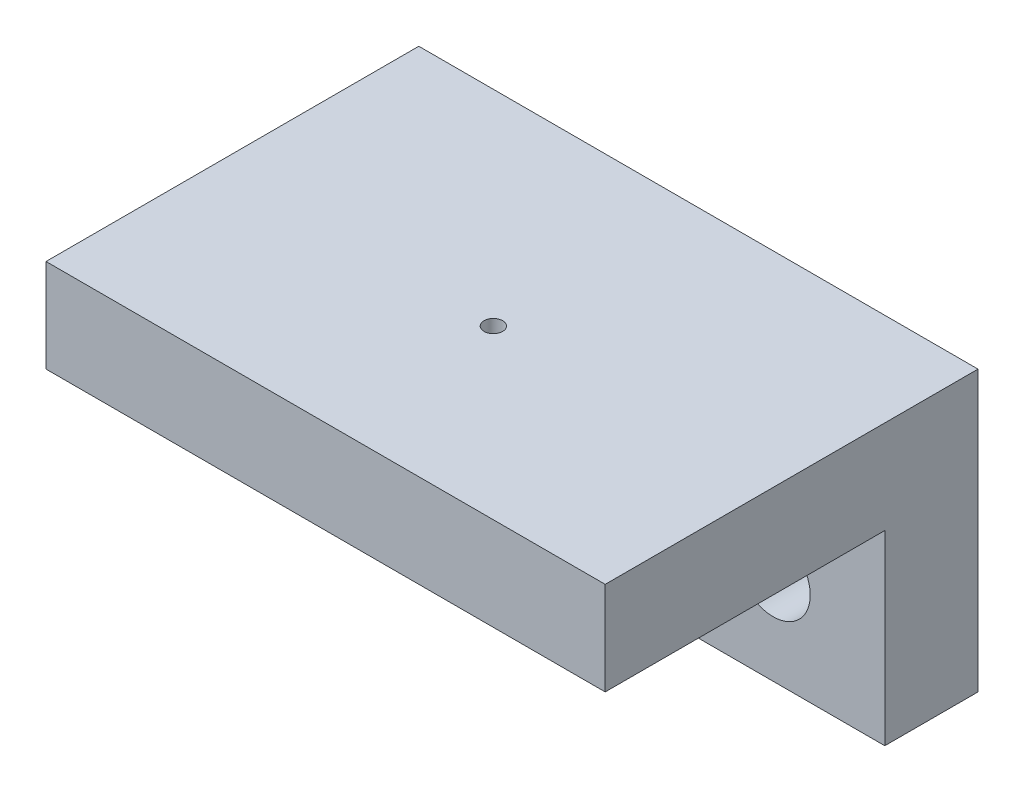
ISO-10303-21;
HEADER;
FILE_DESCRIPTION(('STEP AP214'),'2;1');
FILE_NAME('part.step','',(''),(''),'','','');
FILE_SCHEMA(('AUTOMOTIVE_DESIGN { 1 0 10303 214 1 1 1 1 }'));
ENDSEC;
DATA;
#1=APPLICATION_CONTEXT('core data for automotive mechanical design processes');
#2=APPLICATION_PROTOCOL_DEFINITION('international standard','automotive_design',2000,#1);
#3=PRODUCT_CONTEXT('',#1,'mechanical');
#4=PRODUCT('Part','Part','',(#3));
#5=PRODUCT_RELATED_PRODUCT_CATEGORY('part','',(#4));
#6=PRODUCT_DEFINITION_FORMATION('','',#4);
#7=PRODUCT_DEFINITION_CONTEXT('part definition',#1,'design');
#8=PRODUCT_DEFINITION('design','',#6,#7);
#9=PRODUCT_DEFINITION_SHAPE('','',#8);
#10=(LENGTH_UNIT() NAMED_UNIT(*) SI_UNIT(.MILLI.,.METRE.));
#11=(NAMED_UNIT(*) PLANE_ANGLE_UNIT() SI_UNIT($,.RADIAN.));
#12=(NAMED_UNIT(*) SI_UNIT($,.STERADIAN.) SOLID_ANGLE_UNIT());
#13=UNCERTAINTY_MEASURE_WITH_UNIT(LENGTH_MEASURE(1.E-05),#10,'distance_accuracy_value','');
#14=(GEOMETRIC_REPRESENTATION_CONTEXT(3) GLOBAL_UNCERTAINTY_ASSIGNED_CONTEXT((#13)) GLOBAL_UNIT_ASSIGNED_CONTEXT((#10,
#11,#12)) REPRESENTATION_CONTEXT('',''));
#15=CARTESIAN_POINT('',(0.,0.,0.));
#16=DIRECTION('',(0.,0.,1.));
#17=DIRECTION('',(1.,0.,0.));
#18=AXIS2_PLACEMENT_3D('',#15,#16,#17);
#19=CARTESIAN_POINT('',(0.,0.,5.));
#20=DIRECTION('',(0.,0.,-1.));
#21=DIRECTION('',(-1.,0.,0.));
#22=AXIS2_PLACEMENT_3D('',#19,#20,#21);
#23=PLANE('',#22);
#24=CARTESIAN_POINT('',(6.,5.,5.));
#25=DIRECTION('',(0.,0.,1.));
#26=DIRECTION('',(1.,0.,0.));
#27=AXIS2_PLACEMENT_3D('',#24,#25,#26);
#28=CIRCLE('',#27,2.);
#29=CARTESIAN_POINT('',(8.,5.,5.));
#30=VERTEX_POINT('',#29);
#31=EDGE_CURVE('E124',#30,#30,#28,.T.);
#32=ORIENTED_EDGE('',*,*,#31,.F.);
#33=EDGE_LOOP('',(#32));
#34=FACE_BOUND('',#33,.T.);
#35=CARTESIAN_POINT('',(24.,5.,5.));
#36=DIRECTION('',(0.,0.,1.));
#37=DIRECTION('',(1.,0.,0.));
#38=AXIS2_PLACEMENT_3D('',#35,#36,#37);
#39=CIRCLE('',#38,2.);
#40=CARTESIAN_POINT('',(26.,5.,5.));
#41=VERTEX_POINT('',#40);
#42=EDGE_CURVE('E115',#41,#41,#39,.T.);
#43=ORIENTED_EDGE('',*,*,#42,.F.);
#44=EDGE_LOOP('',(#43));
#45=FACE_BOUND('',#44,.T.);
#46=DIRECTION('',(1.,0.,0.));
#47=VECTOR('',#46,1.);
#48=CARTESIAN_POINT('',(0.,10.,5.));
#49=LINE('',#48,#47);
#50=CARTESIAN_POINT('',(0.,10.,5.));
#51=VERTEX_POINT('',#50);
#52=CARTESIAN_POINT('',(30.,10.,5.));
#53=VERTEX_POINT('',#52);
#54=EDGE_CURVE('E49',#51,#53,#49,.T.);
#55=ORIENTED_EDGE('',*,*,#54,.F.);
#56=DIRECTION('',(0.,-1.,0.));
#57=VECTOR('',#56,1.);
#58=CARTESIAN_POINT('',(0.,0.,5.));
#59=LINE('',#58,#57);
#60=CARTESIAN_POINT('',(0.,0.,5.));
#61=VERTEX_POINT('',#60);
#62=EDGE_CURVE('E86',#51,#61,#59,.T.);
#63=ORIENTED_EDGE('',*,*,#62,.T.);
#64=DIRECTION('',(1.,0.,0.));
#65=VECTOR('',#64,1.);
#66=CARTESIAN_POINT('',(0.,0.,5.));
#67=LINE('',#66,#65);
#68=CARTESIAN_POINT('',(30.,0.,5.));
#69=VERTEX_POINT('',#68);
#70=EDGE_CURVE('E55',#61,#69,#67,.T.);
#71=ORIENTED_EDGE('',*,*,#70,.T.);
#72=DIRECTION('',(0.,1.,0.));
#73=VECTOR('',#72,1.);
#74=CARTESIAN_POINT('',(30.,0.,5.));
#75=LINE('',#74,#73);
#76=EDGE_CURVE('E97',#69,#53,#75,.T.);
#77=ORIENTED_EDGE('',*,*,#76,.T.);
#78=EDGE_LOOP('',(#55,#63,#71,#77));
#79=FACE_BOUND('',#78,.T.);
#80=ADVANCED_FACE('F32',(#34,#45,#79),#23,.F.);
#81=CARTESIAN_POINT('',(0.,0.,5.));
#82=DIRECTION('',(1.,0.,0.));
#83=DIRECTION('',(0.,0.,-1.));
#84=AXIS2_PLACEMENT_3D('',#81,#82,#83);
#85=PLANE('',#84);
#86=DIRECTION('',(0.,-1.,0.));
#87=VECTOR('',#86,1.);
#88=CARTESIAN_POINT('',(0.,0.,0.));
#89=LINE('',#88,#87);
#90=CARTESIAN_POINT('',(0.,15.,0.));
#91=VERTEX_POINT('',#90);
#92=CARTESIAN_POINT('',(0.,0.,0.));
#93=VERTEX_POINT('',#92);
#94=EDGE_CURVE('E93',#91,#93,#89,.T.);
#95=ORIENTED_EDGE('',*,*,#94,.T.);
#96=DIRECTION('',(0.,0.,-1.));
#97=VECTOR('',#96,1.);
#98=CARTESIAN_POINT('',(0.,0.,5.));
#99=LINE('',#98,#97);
#100=EDGE_CURVE('E11',#61,#93,#99,.T.);
#101=ORIENTED_EDGE('',*,*,#100,.F.);
#102=ORIENTED_EDGE('',*,*,#62,.F.);
#103=DIRECTION('',(0.,0.,-1.));
#104=VECTOR('',#103,1.);
#105=CARTESIAN_POINT('',(0.,10.,20.));
#106=LINE('',#105,#104);
#107=CARTESIAN_POINT('',(0.,10.,20.));
#108=VERTEX_POINT('',#107);
#109=EDGE_CURVE('E101',#108,#51,#106,.T.);
#110=ORIENTED_EDGE('',*,*,#109,.F.);
#111=DIRECTION('',(0.,-1.,0.));
#112=VECTOR('',#111,1.);
#113=CARTESIAN_POINT('',(0.,15.,20.));
#114=LINE('',#113,#112);
#115=CARTESIAN_POINT('',(0.,15.,20.));
#116=VERTEX_POINT('',#115);
#117=EDGE_CURVE('E96',#116,#108,#114,.T.);
#118=ORIENTED_EDGE('',*,*,#117,.F.);
#119=DIRECTION('',(0.,0.,-1.));
#120=VECTOR('',#119,1.);
#121=CARTESIAN_POINT('',(0.,15.,5.));
#122=LINE('',#121,#120);
#123=EDGE_CURVE('E79',#116,#91,#122,.T.);
#124=ORIENTED_EDGE('',*,*,#123,.T.);
#125=EDGE_LOOP('',(#95,#101,#102,#110,#118,#124));
#126=FACE_BOUND('',#125,.T.);
#127=ADVANCED_FACE('F34',(#126),#85,.F.);
#128=CARTESIAN_POINT('',(0.,0.,5.));
#129=DIRECTION('',(0.,1.,0.));
#130=DIRECTION('',(0.,0.,1.));
#131=AXIS2_PLACEMENT_3D('',#128,#129,#130);
#132=PLANE('',#131);
#133=DIRECTION('',(1.,0.,0.));
#134=VECTOR('',#133,1.);
#135=CARTESIAN_POINT('',(0.,0.,0.));
#136=LINE('',#135,#134);
#137=CARTESIAN_POINT('',(30.,0.,0.));
#138=VERTEX_POINT('',#137);
#139=EDGE_CURVE('E100',#93,#138,#136,.T.);
#140=ORIENTED_EDGE('',*,*,#139,.T.);
#141=DIRECTION('',(0.,0.,-1.));
#142=VECTOR('',#141,1.);
#143=CARTESIAN_POINT('',(30.,0.,5.));
#144=LINE('',#143,#142);
#145=EDGE_CURVE('E41',#69,#138,#144,.T.);
#146=ORIENTED_EDGE('',*,*,#145,.F.);
#147=ORIENTED_EDGE('',*,*,#70,.F.);
#148=ORIENTED_EDGE('',*,*,#100,.T.);
#149=EDGE_LOOP('',(#140,#146,#147,#148));
#150=FACE_BOUND('',#149,.T.);
#151=ADVANCED_FACE('F158',(#150),#132,.F.);
#152=CARTESIAN_POINT('',(30.,0.,5.));
#153=DIRECTION('',(-1.,0.,0.));
#154=DIRECTION('',(0.,0.,1.));
#155=AXIS2_PLACEMENT_3D('',#152,#153,#154);
#156=PLANE('',#155);
#157=DIRECTION('',(0.,1.,0.));
#158=VECTOR('',#157,1.);
#159=CARTESIAN_POINT('',(30.,0.,0.));
#160=LINE('',#159,#158);
#161=CARTESIAN_POINT('',(30.,15.,0.));
#162=VERTEX_POINT('',#161);
#163=EDGE_CURVE('E87',#138,#162,#160,.T.);
#164=ORIENTED_EDGE('',*,*,#163,.T.);
#165=DIRECTION('',(0.,0.,-1.));
#166=VECTOR('',#165,1.);
#167=CARTESIAN_POINT('',(30.,15.,5.));
#168=LINE('',#167,#166);
#169=CARTESIAN_POINT('',(30.,15.,20.));
#170=VERTEX_POINT('',#169);
#171=EDGE_CURVE('E82',#170,#162,#168,.T.);
#172=ORIENTED_EDGE('',*,*,#171,.F.);
#173=DIRECTION('',(0.,1.,0.));
#174=VECTOR('',#173,1.);
#175=CARTESIAN_POINT('',(30.,15.,20.));
#176=LINE('',#175,#174);
#177=CARTESIAN_POINT('',(30.,10.,20.));
#178=VERTEX_POINT('',#177);
#179=EDGE_CURVE('E132',#178,#170,#176,.T.);
#180=ORIENTED_EDGE('',*,*,#179,.F.);
#181=DIRECTION('',(0.,0.,-1.));
#182=VECTOR('',#181,1.);
#183=CARTESIAN_POINT('',(30.,10.,20.));
#184=LINE('',#183,#182);
#185=EDGE_CURVE('E105',#178,#53,#184,.T.);
#186=ORIENTED_EDGE('',*,*,#185,.T.);
#187=ORIENTED_EDGE('',*,*,#76,.F.);
#188=ORIENTED_EDGE('',*,*,#145,.T.);
#189=EDGE_LOOP('',(#164,#172,#180,#186,#187,#188));
#190=FACE_BOUND('',#189,.T.);
#191=ADVANCED_FACE('F149',(#190),#156,.F.);
#192=CARTESIAN_POINT('',(0.,15.,5.));
#193=DIRECTION('',(0.,-1.,0.));
#194=DIRECTION('',(0.,0.,-1.));
#195=AXIS2_PLACEMENT_3D('',#192,#193,#194);
#196=PLANE('',#195);
#197=CARTESIAN_POINT('',(15.,15.,11.));
#198=DIRECTION('',(0.,-1.,0.));
#199=DIRECTION('',(0.,0.,-1.));
#200=AXIS2_PLACEMENT_3D('',#197,#198,#199);
#201=CIRCLE('',#200,0.500000000000001);
#202=CARTESIAN_POINT('',(15.,15.,10.5));
#203=VERTEX_POINT('',#202);
#204=EDGE_CURVE('E184',#203,#203,#201,.T.);
#205=ORIENTED_EDGE('',*,*,#204,.T.);
#206=EDGE_LOOP('',(#205));
#207=FACE_BOUND('',#206,.T.);
#208=DIRECTION('',(-1.,0.,0.));
#209=VECTOR('',#208,1.);
#210=CARTESIAN_POINT('',(0.,15.,0.));
#211=LINE('',#210,#209);
#212=EDGE_CURVE('E75',#162,#91,#211,.T.);
#213=ORIENTED_EDGE('',*,*,#212,.T.);
#214=ORIENTED_EDGE('',*,*,#123,.F.);
#215=DIRECTION('',(-1.,0.,0.));
#216=VECTOR('',#215,1.);
#217=CARTESIAN_POINT('',(0.,15.,20.));
#218=LINE('',#217,#216);
#219=EDGE_CURVE('E135',#170,#116,#218,.T.);
#220=ORIENTED_EDGE('',*,*,#219,.F.);
#221=ORIENTED_EDGE('',*,*,#171,.T.);
#222=EDGE_LOOP('',(#213,#214,#220,#221));
#223=FACE_BOUND('',#222,.T.);
#224=ADVANCED_FACE('F77',(#207,#223),#196,.F.);
#225=CARTESIAN_POINT('',(0.,0.,0.));
#226=DIRECTION('',(0.,0.,-1.));
#227=DIRECTION('',(-1.,0.,0.));
#228=AXIS2_PLACEMENT_3D('',#225,#226,#227);
#229=PLANE('',#228);
#230=CARTESIAN_POINT('',(6.,5.,0.));
#231=DIRECTION('',(0.,0.,-1.));
#232=DIRECTION('',(-1.,0.,0.));
#233=AXIS2_PLACEMENT_3D('',#230,#231,#232);
#234=CIRCLE('',#233,2.);
#235=CARTESIAN_POINT('',(4.,5.,0.));
#236=VERTEX_POINT('',#235);
#237=EDGE_CURVE('E36',#236,#236,#234,.T.);
#238=ORIENTED_EDGE('',*,*,#237,.F.);
#239=EDGE_LOOP('',(#238));
#240=FACE_BOUND('',#239,.T.);
#241=CARTESIAN_POINT('',(24.,5.,0.));
#242=DIRECTION('',(0.,0.,-1.));
#243=DIRECTION('',(-1.,0.,0.));
#244=AXIS2_PLACEMENT_3D('',#241,#242,#243);
#245=CIRCLE('',#244,2.);
#246=CARTESIAN_POINT('',(22.,5.,0.));
#247=VERTEX_POINT('',#246);
#248=EDGE_CURVE('E113',#247,#247,#245,.T.);
#249=ORIENTED_EDGE('',*,*,#248,.F.);
#250=EDGE_LOOP('',(#249));
#251=FACE_BOUND('',#250,.T.);
#252=ORIENTED_EDGE('',*,*,#94,.F.);
#253=ORIENTED_EDGE('',*,*,#212,.F.);
#254=ORIENTED_EDGE('',*,*,#163,.F.);
#255=ORIENTED_EDGE('',*,*,#139,.F.);
#256=EDGE_LOOP('',(#252,#253,#254,#255));
#257=FACE_BOUND('',#256,.T.);
#258=ADVANCED_FACE('F99',(#240,#251,#257),#229,.T.);
#259=CARTESIAN_POINT('',(0.,10.,20.));
#260=DIRECTION('',(0.,1.,0.));
#261=DIRECTION('',(0.,0.,1.));
#262=AXIS2_PLACEMENT_3D('',#259,#260,#261);
#263=PLANE('',#262);
#264=CARTESIAN_POINT('',(15.,10.,11.));
#265=DIRECTION('',(0.,-1.,0.));
#266=DIRECTION('',(0.,0.,-1.));
#267=AXIS2_PLACEMENT_3D('',#264,#265,#266);
#268=CIRCLE('',#267,0.500000000000001);
#269=CARTESIAN_POINT('',(15.,10.,10.5));
#270=VERTEX_POINT('',#269);
#271=EDGE_CURVE('E186',#270,#270,#268,.T.);
#272=ORIENTED_EDGE('',*,*,#271,.F.);
#273=EDGE_LOOP('',(#272));
#274=FACE_BOUND('',#273,.T.);
#275=ORIENTED_EDGE('',*,*,#54,.T.);
#276=ORIENTED_EDGE('',*,*,#185,.F.);
#277=DIRECTION('',(1.,0.,0.));
#278=VECTOR('',#277,1.);
#279=CARTESIAN_POINT('',(0.,10.,20.));
#280=LINE('',#279,#278);
#281=EDGE_CURVE('E129',#108,#178,#280,.T.);
#282=ORIENTED_EDGE('',*,*,#281,.F.);
#283=ORIENTED_EDGE('',*,*,#109,.T.);
#284=EDGE_LOOP('',(#275,#276,#282,#283));
#285=FACE_BOUND('',#284,.T.);
#286=ADVANCED_FACE('F145',(#274,#285),#263,.F.);
#287=CARTESIAN_POINT('',(0.,0.,20.));
#288=DIRECTION('',(0.,0.,1.));
#289=DIRECTION('',(1.,0.,0.));
#290=AXIS2_PLACEMENT_3D('',#287,#288,#289);
#291=PLANE('',#290);
#292=ORIENTED_EDGE('',*,*,#117,.T.);
#293=ORIENTED_EDGE('',*,*,#281,.T.);
#294=ORIENTED_EDGE('',*,*,#179,.T.);
#295=ORIENTED_EDGE('',*,*,#219,.T.);
#296=EDGE_LOOP('',(#292,#293,#294,#295));
#297=FACE_BOUND('',#296,.T.);
#298=ADVANCED_FACE('F153',(#297),#291,.T.);
#299=CARTESIAN_POINT('',(24.,5.,-10.));
#300=DIRECTION('',(0.,0.,1.));
#301=DIRECTION('',(1.,0.,0.));
#302=AXIS2_PLACEMENT_3D('',#299,#300,#301);
#303=CYLINDRICAL_SURFACE('',#302,2.);
#304=ORIENTED_EDGE('',*,*,#248,.T.);
#305=EDGE_LOOP('',(#304));
#306=FACE_BOUND('',#305,.T.);
#307=ORIENTED_EDGE('',*,*,#42,.T.);
#308=EDGE_LOOP('',(#307));
#309=FACE_BOUND('',#308,.T.);
#310=ADVANCED_FACE('F198',(#306,#309),#303,.F.);
#311=CARTESIAN_POINT('',(6.,5.,-10.));
#312=DIRECTION('',(0.,0.,1.));
#313=DIRECTION('',(1.,0.,0.));
#314=AXIS2_PLACEMENT_3D('',#311,#312,#313);
#315=CYLINDRICAL_SURFACE('',#314,2.);
#316=ORIENTED_EDGE('',*,*,#237,.T.);
#317=EDGE_LOOP('',(#316));
#318=FACE_BOUND('',#317,.T.);
#319=ORIENTED_EDGE('',*,*,#31,.T.);
#320=EDGE_LOOP('',(#319));
#321=FACE_BOUND('',#320,.T.);
#322=ADVANCED_FACE('F202',(#318,#321),#315,.F.);
#323=CARTESIAN_POINT('',(15.,20.,11.));
#324=DIRECTION('',(0.,-1.,0.));
#325=DIRECTION('',(0.,0.,-1.));
#326=AXIS2_PLACEMENT_3D('',#323,#324,#325);
#327=CYLINDRICAL_SURFACE('',#326,0.500000000000001);
#328=ORIENTED_EDGE('',*,*,#271,.T.);
#329=EDGE_LOOP('',(#328));
#330=FACE_BOUND('',#329,.T.);
#331=ORIENTED_EDGE('',*,*,#204,.F.);
#332=EDGE_LOOP('',(#331));
#333=FACE_BOUND('',#332,.T.);
#334=ADVANCED_FACE('F192',(#330,#333),#327,.F.);
#335=CLOSED_SHELL('',(#80,#127,#151,#191,#224,#258,#286,#298,#310,#322,#334));
#336=MANIFOLD_SOLID_BREP('B2',#335);
#337=ADVANCED_BREP_SHAPE_REPRESENTATION('',(#18,#336),#14);
#338=SHAPE_DEFINITION_REPRESENTATION(#9,#337);
ENDSEC;
END-ISO-10303-21;
